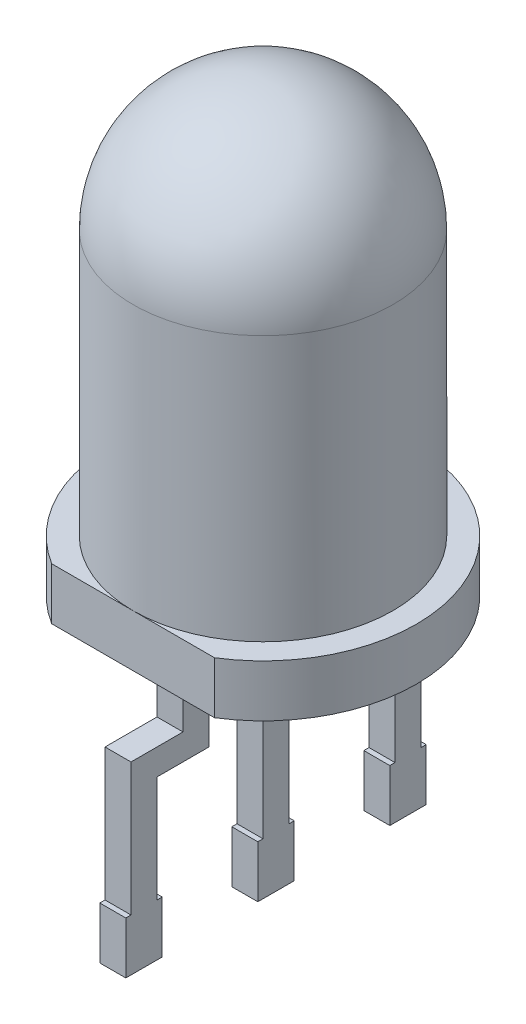
ISO-10303-21;
HEADER;
FILE_DESCRIPTION(('STEP AP214'),'2;1');
FILE_NAME('part.step','',(''),(''),'','','');
FILE_SCHEMA(('AUTOMOTIVE_DESIGN { 1 0 10303 214 1 1 1 1 }'));
ENDSEC;
DATA;
#1=APPLICATION_CONTEXT('core data for automotive mechanical design processes');
#2=APPLICATION_PROTOCOL_DEFINITION('international standard','automotive_design',2000,#1);
#3=PRODUCT_CONTEXT('',#1,'mechanical');
#4=PRODUCT('Part','Part','',(#3));
#5=PRODUCT_RELATED_PRODUCT_CATEGORY('part','',(#4));
#6=PRODUCT_DEFINITION_FORMATION('','',#4);
#7=PRODUCT_DEFINITION_CONTEXT('part definition',#1,'design');
#8=PRODUCT_DEFINITION('design','',#6,#7);
#9=PRODUCT_DEFINITION_SHAPE('','',#8);
#10=(LENGTH_UNIT() NAMED_UNIT(*) SI_UNIT(.MILLI.,.METRE.));
#11=(NAMED_UNIT(*) PLANE_ANGLE_UNIT() SI_UNIT($,.RADIAN.));
#12=(NAMED_UNIT(*) SI_UNIT($,.STERADIAN.) SOLID_ANGLE_UNIT());
#13=UNCERTAINTY_MEASURE_WITH_UNIT(LENGTH_MEASURE(1.E-05),#10,'distance_accuracy_value','');
#14=(GEOMETRIC_REPRESENTATION_CONTEXT(3) GLOBAL_UNCERTAINTY_ASSIGNED_CONTEXT((#13)) GLOBAL_UNIT_ASSIGNED_CONTEXT((#10,
#11,#12)) REPRESENTATION_CONTEXT('',''));
#15=CARTESIAN_POINT('',(0.,0.,0.));
#16=DIRECTION('',(0.,0.,1.));
#17=DIRECTION('',(1.,0.,0.));
#18=AXIS2_PLACEMENT_3D('',#15,#16,#17);
#19=CARTESIAN_POINT('',(-0.25,-4.8,2.89));
#20=DIRECTION('',(1.,0.,0.));
#21=DIRECTION('',(0.,0.,-1.));
#22=AXIS2_PLACEMENT_3D('',#19,#20,#21);
#23=PLANE('',#22);
#24=DIRECTION('',(0.,1.,0.));
#25=VECTOR('',#24,1.);
#26=CARTESIAN_POINT('',(-0.25,-2.25,2.79));
#27=LINE('',#26,#25);
#28=CARTESIAN_POINT('',(-0.25,-4.8,2.79));
#29=VERTEX_POINT('',#28);
#30=CARTESIAN_POINT('',(-0.25,-2.25,2.79));
#31=VERTEX_POINT('',#30);
#32=EDGE_CURVE('E436',#29,#31,#27,.T.);
#33=ORIENTED_EDGE('',*,*,#32,.T.);
#34=DIRECTION('',(0.,0.,-1.));
#35=VECTOR('',#34,1.);
#36=CARTESIAN_POINT('',(-0.25,-2.25,2.89));
#37=LINE('',#36,#35);
#38=CARTESIAN_POINT('',(-0.25,-2.25,1.79));
#39=VERTEX_POINT('',#38);
#40=EDGE_CURVE('E245',#39,#31,#37,.F.);
#41=ORIENTED_EDGE('',*,*,#40,.F.);
#42=DIRECTION('',(0.,1.,0.));
#43=VECTOR('',#42,1.);
#44=CARTESIAN_POINT('',(-0.25,-4.8,1.79));
#45=LINE('',#44,#43);
#46=CARTESIAN_POINT('',(-0.25,-1.,1.79));
#47=VERTEX_POINT('',#46);
#48=EDGE_CURVE('E222',#47,#39,#45,.F.);
#49=ORIENTED_EDGE('',*,*,#48,.F.);
#50=DIRECTION('',(0.,0.,-1.));
#51=VECTOR('',#50,1.);
#52=CARTESIAN_POINT('',(-0.25,-1.,2.89));
#53=LINE('',#52,#51);
#54=CARTESIAN_POINT('',(-0.25,-1.,1.29));
#55=VERTEX_POINT('',#54);
#56=EDGE_CURVE('E228',#55,#47,#53,.F.);
#57=ORIENTED_EDGE('',*,*,#56,.F.);
#58=DIRECTION('',(0.,1.,0.));
#59=VECTOR('',#58,1.);
#60=CARTESIAN_POINT('',(-0.25,-2.75,1.29));
#61=LINE('',#60,#59);
#62=CARTESIAN_POINT('',(-0.25,-2.75,1.29));
#63=VERTEX_POINT('',#62);
#64=EDGE_CURVE('E440',#55,#63,#61,.F.);
#65=ORIENTED_EDGE('',*,*,#64,.T.);
#66=DIRECTION('',(0.,0.,1.));
#67=VECTOR('',#66,1.);
#68=CARTESIAN_POINT('',(-0.25,-2.75,2.29));
#69=LINE('',#68,#67);
#70=CARTESIAN_POINT('',(-0.25,-2.75,2.29));
#71=VERTEX_POINT('',#70);
#72=EDGE_CURVE('E445',#63,#71,#69,.T.);
#73=ORIENTED_EDGE('',*,*,#72,.T.);
#74=DIRECTION('',(0.,1.,0.));
#75=VECTOR('',#74,1.);
#76=CARTESIAN_POINT('',(-0.25,-23.5,2.29));
#77=LINE('',#76,#75);
#78=CARTESIAN_POINT('',(-0.25,-4.8,2.29));
#79=VERTEX_POINT('',#78);
#80=EDGE_CURVE('E447',#71,#79,#77,.F.);
#81=ORIENTED_EDGE('',*,*,#80,.T.);
#82=DIRECTION('',(0.,0.,-1.));
#83=VECTOR('',#82,1.);
#84=CARTESIAN_POINT('',(-0.25,-4.8,2.19));
#85=LINE('',#84,#83);
#86=CARTESIAN_POINT('',(-0.25,-4.8,2.19));
#87=VERTEX_POINT('',#86);
#88=EDGE_CURVE('E454',#79,#87,#85,.T.);
#89=ORIENTED_EDGE('',*,*,#88,.T.);
#90=DIRECTION('',(0.,1.,0.));
#91=VECTOR('',#90,1.);
#92=CARTESIAN_POINT('',(-0.25,-4.8,2.19));
#93=LINE('',#92,#91);
#94=CARTESIAN_POINT('',(-0.25,-5.8,2.19));
#95=VERTEX_POINT('',#94);
#96=EDGE_CURVE('E456',#95,#87,#93,.T.);
#97=ORIENTED_EDGE('',*,*,#96,.F.);
#98=DIRECTION('',(0.,0.,1.));
#99=VECTOR('',#98,1.);
#100=CARTESIAN_POINT('',(-0.25,-5.8,0.7891280055548));
#101=LINE('',#100,#99);
#102=CARTESIAN_POINT('',(-0.25,-5.8,2.89));
#103=VERTEX_POINT('',#102);
#104=EDGE_CURVE('E462',#95,#103,#101,.T.);
#105=ORIENTED_EDGE('',*,*,#104,.T.);
#106=DIRECTION('',(0.,1.,0.));
#107=VECTOR('',#106,1.);
#108=CARTESIAN_POINT('',(-0.25,-4.8,2.89));
#109=LINE('',#108,#107);
#110=CARTESIAN_POINT('',(-0.25,-4.8,2.89));
#111=VERTEX_POINT('',#110);
#112=EDGE_CURVE('E467',#103,#111,#109,.T.);
#113=ORIENTED_EDGE('',*,*,#112,.T.);
#114=DIRECTION('',(0.,0.,-1.));
#115=VECTOR('',#114,1.);
#116=CARTESIAN_POINT('',(-0.25,-4.8,2.89));
#117=LINE('',#116,#115);
#118=EDGE_CURVE('E247',#29,#111,#117,.F.);
#119=ORIENTED_EDGE('',*,*,#118,.F.);
#120=EDGE_LOOP('',(#33,#41,#49,#57,#65,#73,#81,#89,#97,#105,#113,#119));
#121=FACE_BOUND('',#120,.T.);
#122=ADVANCED_FACE('F16',(#121),#23,.F.);
#123=CARTESIAN_POINT('',(0.25,-33.31016093332,0.7891280055548));
#124=DIRECTION('',(-1.,0.,0.));
#125=DIRECTION('',(0.,0.,1.));
#126=AXIS2_PLACEMENT_3D('',#123,#124,#125);
#127=PLANE('',#126);
#128=DIRECTION('',(0.,1.,0.));
#129=VECTOR('',#128,1.);
#130=CARTESIAN_POINT('',(0.25,-33.31016093332,-2.79));
#131=LINE('',#130,#129);
#132=CARTESIAN_POINT('',(0.25,-4.8,-2.79000000000034));
#133=VERTEX_POINT('',#132);
#134=CARTESIAN_POINT('',(0.25,-2.7499999999991,-2.79000000000152));
#135=VERTEX_POINT('',#134);
#136=EDGE_CURVE('E387',#133,#135,#131,.T.);
#137=ORIENTED_EDGE('',*,*,#136,.T.);
#138=DIRECTION('',(0.,-0.882947592858917,-0.469471562785909));
#139=VECTOR('',#138,1.);
#140=CARTESIAN_POINT('',(0.25,-25.09097723128,-14.66890830641));
#141=LINE('',#140,#139);
#142=CARTESIAN_POINT('',(0.25,-0.999999999999557,-1.85950849459334));
#143=VERTEX_POINT('',#142);
#144=EDGE_CURVE('E392',#135,#143,#141,.F.);
#145=ORIENTED_EDGE('',*,*,#144,.T.);
#146=DIRECTION('',(0.,0.,1.));
#147=VECTOR('',#146,1.);
#148=CARTESIAN_POINT('',(0.25,-0.99999999999982,0.7891280055548));
#149=LINE('',#148,#147);
#150=CARTESIAN_POINT('',(0.25,-0.999999999999865,-1.35950849459242));
#151=VERTEX_POINT('',#150);
#152=EDGE_CURVE('E477',#151,#143,#149,.F.);
#153=ORIENTED_EDGE('',*,*,#152,.F.);
#154=DIRECTION('',(0.,0.882947592858917,0.469471562785909));
#155=VECTOR('',#154,1.);
#156=CARTESIAN_POINT('',(0.25,-25.29823662442,-14.27911008054));
#157=LINE('',#156,#155);
#158=CARTESIAN_POINT('',(0.25,-2.74999999999987,-2.2900000000001));
#159=VERTEX_POINT('',#158);
#160=EDGE_CURVE('E398',#151,#159,#157,.F.);
#161=ORIENTED_EDGE('',*,*,#160,.T.);
#162=DIRECTION('',(0.,1.,0.));
#163=VECTOR('',#162,1.);
#164=CARTESIAN_POINT('',(0.25,-33.31016093332,-2.29));
#165=LINE('',#164,#163);
#166=CARTESIAN_POINT('',(0.25,-4.8,-2.29));
#167=VERTEX_POINT('',#166);
#168=EDGE_CURVE('E405',#159,#167,#165,.F.);
#169=ORIENTED_EDGE('',*,*,#168,.T.);
#170=DIRECTION('',(0.,0.,1.));
#171=VECTOR('',#170,1.);
#172=CARTESIAN_POINT('',(0.25,-4.8,0.7891280055548));
#173=LINE('',#172,#171);
#174=CARTESIAN_POINT('',(0.25,-4.8,-2.19));
#175=VERTEX_POINT('',#174);
#176=EDGE_CURVE('E410',#175,#167,#173,.F.);
#177=ORIENTED_EDGE('',*,*,#176,.F.);
#178=DIRECTION('',(0.,1.,0.));
#179=VECTOR('',#178,1.);
#180=CARTESIAN_POINT('',(0.25,-33.31016093332,-2.19));
#181=LINE('',#180,#179);
#182=CARTESIAN_POINT('',(0.25,-5.8,-2.19));
#183=VERTEX_POINT('',#182);
#184=EDGE_CURVE('E415',#183,#175,#181,.T.);
#185=ORIENTED_EDGE('',*,*,#184,.F.);
#186=DIRECTION('',(0.,0.,1.));
#187=VECTOR('',#186,1.);
#188=CARTESIAN_POINT('',(0.25,-5.8,0.7891280055548));
#189=LINE('',#188,#187);
#190=CARTESIAN_POINT('',(0.25,-5.8,-2.89));
#191=VERTEX_POINT('',#190);
#192=EDGE_CURVE('E420',#183,#191,#189,.F.);
#193=ORIENTED_EDGE('',*,*,#192,.T.);
#194=DIRECTION('',(0.,1.,0.));
#195=VECTOR('',#194,1.);
#196=CARTESIAN_POINT('',(0.25,-33.31016093332,-2.89));
#197=LINE('',#196,#195);
#198=CARTESIAN_POINT('',(0.25,-4.8,-2.89));
#199=VERTEX_POINT('',#198);
#200=EDGE_CURVE('E425',#191,#199,#197,.T.);
#201=ORIENTED_EDGE('',*,*,#200,.T.);
#202=DIRECTION('',(0.,0.,1.));
#203=VECTOR('',#202,1.);
#204=CARTESIAN_POINT('',(0.25,-4.8,0.7891280055548));
#205=LINE('',#204,#203);
#206=EDGE_CURVE('E475',#133,#199,#205,.F.);
#207=ORIENTED_EDGE('',*,*,#206,.F.);
#208=EDGE_LOOP('',(#137,#145,#153,#161,#169,#177,#185,#193,#201,#207));
#209=FACE_BOUND('',#208,.T.);
#210=ADVANCED_FACE('F543',(#209),#127,.F.);
#211=CARTESIAN_POINT('',(0.25,-1.,0.25));
#212=DIRECTION('',(1.,0.,0.));
#213=DIRECTION('',(0.,0.,-1.));
#214=AXIS2_PLACEMENT_3D('',#211,#212,#213);
#215=PLANE('',#214);
#216=DIRECTION('',(0.,1.,0.));
#217=VECTOR('',#216,1.);
#218=CARTESIAN_POINT('',(0.25,-25.5,0.25));
#219=LINE('',#218,#217);
#220=CARTESIAN_POINT('',(0.25,-4.8,0.25));
#221=VERTEX_POINT('',#220);
#222=CARTESIAN_POINT('',(0.25,-1.,0.25));
#223=VERTEX_POINT('',#222);
#224=EDGE_CURVE('E349',#221,#223,#219,.T.);
#225=ORIENTED_EDGE('',*,*,#224,.F.);
#226=DIRECTION('',(0.,0.,-1.));
#227=VECTOR('',#226,1.);
#228=CARTESIAN_POINT('',(0.25,-4.8,0.25));
#229=LINE('',#228,#227);
#230=CARTESIAN_POINT('',(0.25,-4.8,0.35));
#231=VERTEX_POINT('',#230);
#232=EDGE_CURVE('E470',#221,#231,#229,.F.);
#233=ORIENTED_EDGE('',*,*,#232,.T.);
#234=DIRECTION('',(0.,1.,0.));
#235=VECTOR('',#234,1.);
#236=CARTESIAN_POINT('',(0.25,-4.8,0.35));
#237=LINE('',#236,#235);
#238=CARTESIAN_POINT('',(0.25,-5.8,0.35));
#239=VERTEX_POINT('',#238);
#240=EDGE_CURVE('E379',#231,#239,#237,.F.);
#241=ORIENTED_EDGE('',*,*,#240,.T.);
#242=DIRECTION('',(0.,0.,1.));
#243=VECTOR('',#242,1.);
#244=CARTESIAN_POINT('',(0.25,-5.8,0.7891280055548));
#245=LINE('',#244,#243);
#246=CARTESIAN_POINT('',(0.25,-5.8,-0.35));
#247=VERTEX_POINT('',#246);
#248=EDGE_CURVE('E374',#239,#247,#245,.F.);
#249=ORIENTED_EDGE('',*,*,#248,.T.);
#250=DIRECTION('',(0.,1.,0.));
#251=VECTOR('',#250,1.);
#252=CARTESIAN_POINT('',(0.25,-4.8,-0.35));
#253=LINE('',#252,#251);
#254=CARTESIAN_POINT('',(0.25,-4.8,-0.35));
#255=VERTEX_POINT('',#254);
#256=EDGE_CURVE('E368',#255,#247,#253,.F.);
#257=ORIENTED_EDGE('',*,*,#256,.F.);
#258=DIRECTION('',(0.,0.,-1.));
#259=VECTOR('',#258,1.);
#260=CARTESIAN_POINT('',(0.25,-4.8,-0.35));
#261=LINE('',#260,#259);
#262=CARTESIAN_POINT('',(0.25,-4.8,-0.25));
#263=VERTEX_POINT('',#262);
#264=EDGE_CURVE('E366',#255,#263,#261,.F.);
#265=ORIENTED_EDGE('',*,*,#264,.T.);
#266=DIRECTION('',(0.,1.,0.));
#267=VECTOR('',#266,1.);
#268=CARTESIAN_POINT('',(0.25,-1.,-0.25));
#269=LINE('',#268,#267);
#270=CARTESIAN_POINT('',(0.25,-1.,-0.25));
#271=VERTEX_POINT('',#270);
#272=EDGE_CURVE('E357',#271,#263,#269,.F.);
#273=ORIENTED_EDGE('',*,*,#272,.F.);
#274=DIRECTION('',(0.,0.,-1.));
#275=VECTOR('',#274,1.);
#276=CARTESIAN_POINT('',(0.25,-1.,0.25));
#277=LINE('',#276,#275);
#278=EDGE_CURVE('E472',#271,#223,#277,.F.);
#279=ORIENTED_EDGE('',*,*,#278,.T.);
#280=EDGE_LOOP('',(#225,#233,#241,#249,#257,#265,#273,#279));
#281=FACE_BOUND('',#280,.T.);
#282=ADVANCED_FACE('F541',(#281),#215,.T.);
#283=CARTESIAN_POINT('',(0.25,-4.8,2.89));
#284=DIRECTION('',(0.,0.,-1.));
#285=DIRECTION('',(-1.,0.,0.));
#286=AXIS2_PLACEMENT_3D('',#283,#284,#285);
#287=PLANE('',#286);
#288=DIRECTION('',(1.,0.,0.));
#289=VECTOR('',#288,1.);
#290=CARTESIAN_POINT('',(0.25,-4.8,2.89));
#291=LINE('',#290,#289);
#292=CARTESIAN_POINT('',(0.25,-4.8,2.89));
#293=VERTEX_POINT('',#292);
#294=EDGE_CURVE('E431',#293,#111,#291,.F.);
#295=ORIENTED_EDGE('',*,*,#294,.T.);
#296=ORIENTED_EDGE('',*,*,#112,.F.);
#297=DIRECTION('',(1.,0.,0.));
#298=VECTOR('',#297,1.);
#299=CARTESIAN_POINT('',(0.25,-5.8,2.89));
#300=LINE('',#299,#298);
#301=CARTESIAN_POINT('',(0.25,-5.8,2.89));
#302=VERTEX_POINT('',#301);
#303=EDGE_CURVE('E465',#103,#302,#300,.T.);
#304=ORIENTED_EDGE('',*,*,#303,.T.);
#305=DIRECTION('',(0.,1.,0.));
#306=VECTOR('',#305,1.);
#307=CARTESIAN_POINT('',(0.25,-4.8,2.89));
#308=LINE('',#307,#306);
#309=EDGE_CURVE('E342',#293,#302,#308,.F.);
#310=ORIENTED_EDGE('',*,*,#309,.F.);
#311=EDGE_LOOP('',(#295,#296,#304,#310));
#312=FACE_BOUND('',#311,.T.);
#313=ADVANCED_FACE('F487',(#312),#287,.F.);
#314=CARTESIAN_POINT('',(0.25,-5.8,0.7891280055548));
#315=DIRECTION('',(0.,1.,0.));
#316=DIRECTION('',(0.,0.,1.));
#317=AXIS2_PLACEMENT_3D('',#314,#315,#316);
#318=PLANE('',#317);
#319=DIRECTION('',(-1.,0.,0.));
#320=VECTOR('',#319,1.);
#321=CARTESIAN_POINT('',(0.25,-5.8,2.19));
#322=LINE('',#321,#320);
#323=CARTESIAN_POINT('',(0.25,-5.8,2.19));
#324=VERTEX_POINT('',#323);
#325=EDGE_CURVE('E459',#324,#95,#322,.T.);
#326=ORIENTED_EDGE('',*,*,#325,.F.);
#327=DIRECTION('',(0.,0.,-1.));
#328=VECTOR('',#327,1.);
#329=CARTESIAN_POINT('',(0.25,-5.8,2.89));
#330=LINE('',#329,#328);
#331=EDGE_CURVE('E339',#302,#324,#330,.T.);
#332=ORIENTED_EDGE('',*,*,#331,.F.);
#333=ORIENTED_EDGE('',*,*,#303,.F.);
#334=ORIENTED_EDGE('',*,*,#104,.F.);
#335=EDGE_LOOP('',(#326,#332,#333,#334));
#336=FACE_BOUND('',#335,.T.);
#337=ADVANCED_FACE('F550',(#336),#318,.F.);
#338=CARTESIAN_POINT('',(0.25,-4.8,2.19));
#339=DIRECTION('',(0.,0.,-1.));
#340=DIRECTION('',(-1.,0.,0.));
#341=AXIS2_PLACEMENT_3D('',#338,#339,#340);
#342=PLANE('',#341);
#343=DIRECTION('',(1.,0.,0.));
#344=VECTOR('',#343,1.);
#345=CARTESIAN_POINT('',(0.25,-4.8,2.19));
#346=LINE('',#345,#344);
#347=CARTESIAN_POINT('',(0.25,-4.8,2.19));
#348=VERTEX_POINT('',#347);
#349=EDGE_CURVE('E452',#87,#348,#346,.T.);
#350=ORIENTED_EDGE('',*,*,#349,.T.);
#351=DIRECTION('',(0.,1.,0.));
#352=VECTOR('',#351,1.);
#353=CARTESIAN_POINT('',(0.25,-4.8,2.19));
#354=LINE('',#353,#352);
#355=EDGE_CURVE('E336',#324,#348,#354,.T.);
#356=ORIENTED_EDGE('',*,*,#355,.F.);
#357=ORIENTED_EDGE('',*,*,#325,.T.);
#358=ORIENTED_EDGE('',*,*,#96,.T.);
#359=EDGE_LOOP('',(#350,#356,#357,#358));
#360=FACE_BOUND('',#359,.T.);
#361=ADVANCED_FACE('F657',(#360),#342,.T.);
#362=CARTESIAN_POINT('',(0.25,-4.8,2.19));
#363=DIRECTION('',(0.,-1.,0.));
#364=DIRECTION('',(0.,0.,-1.));
#365=AXIS2_PLACEMENT_3D('',#362,#363,#364);
#366=PLANE('',#365);
#367=ORIENTED_EDGE('',*,*,#88,.F.);
#368=DIRECTION('',(1.,0.,0.));
#369=VECTOR('',#368,1.);
#370=CARTESIAN_POINT('',(0.25,-4.8,2.29));
#371=LINE('',#370,#369);
#372=CARTESIAN_POINT('',(0.25,-4.8,2.29));
#373=VERTEX_POINT('',#372);
#374=EDGE_CURVE('E450',#79,#373,#371,.T.);
#375=ORIENTED_EDGE('',*,*,#374,.T.);
#376=DIRECTION('',(0.,0.,-1.));
#377=VECTOR('',#376,1.);
#378=CARTESIAN_POINT('',(0.25,-4.8,2.89));
#379=LINE('',#378,#377);
#380=EDGE_CURVE('E333',#348,#373,#379,.F.);
#381=ORIENTED_EDGE('',*,*,#380,.F.);
#382=ORIENTED_EDGE('',*,*,#349,.F.);
#383=EDGE_LOOP('',(#367,#375,#381,#382));
#384=FACE_BOUND('',#383,.T.);
#385=ADVANCED_FACE('F653',(#384),#366,.F.);
#386=CARTESIAN_POINT('',(0.25,-23.5,2.29));
#387=DIRECTION('',(0.,0.,1.));
#388=DIRECTION('',(1.,0.,0.));
#389=AXIS2_PLACEMENT_3D('',#386,#387,#388);
#390=PLANE('',#389);
#391=DIRECTION('',(1.,0.,0.));
#392=VECTOR('',#391,1.);
#393=CARTESIAN_POINT('',(0.25,-2.75,2.29));
#394=LINE('',#393,#392);
#395=CARTESIAN_POINT('',(0.25,-2.75,2.29));
#396=VERTEX_POINT('',#395);
#397=EDGE_CURVE('E443',#71,#396,#394,.T.);
#398=ORIENTED_EDGE('',*,*,#397,.T.);
#399=DIRECTION('',(0.,1.,0.));
#400=VECTOR('',#399,1.);
#401=CARTESIAN_POINT('',(0.25,-4.8,2.29));
#402=LINE('',#401,#400);
#403=EDGE_CURVE('E330',#373,#396,#402,.T.);
#404=ORIENTED_EDGE('',*,*,#403,.F.);
#405=ORIENTED_EDGE('',*,*,#374,.F.);
#406=ORIENTED_EDGE('',*,*,#80,.F.);
#407=EDGE_LOOP('',(#398,#404,#405,#406));
#408=FACE_BOUND('',#407,.T.);
#409=ADVANCED_FACE('F649',(#408),#390,.F.);
#410=CARTESIAN_POINT('',(0.25,-2.75,2.29));
#411=DIRECTION('',(0.,1.,0.));
#412=DIRECTION('',(0.,0.,1.));
#413=AXIS2_PLACEMENT_3D('',#410,#411,#412);
#414=PLANE('',#413);
#415=ORIENTED_EDGE('',*,*,#397,.F.);
#416=ORIENTED_EDGE('',*,*,#72,.F.);
#417=DIRECTION('',(1.,0.,0.));
#418=VECTOR('',#417,1.);
#419=CARTESIAN_POINT('',(0.25,-2.75,1.29));
#420=LINE('',#419,#418);
#421=CARTESIAN_POINT('',(0.25,-2.75,1.29));
#422=VERTEX_POINT('',#421);
#423=EDGE_CURVE('E438',#63,#422,#420,.T.);
#424=ORIENTED_EDGE('',*,*,#423,.T.);
#425=DIRECTION('',(0.,0.,-1.));
#426=VECTOR('',#425,1.);
#427=CARTESIAN_POINT('',(0.25,-2.75,2.89));
#428=LINE('',#427,#426);
#429=EDGE_CURVE('E327',#396,#422,#428,.T.);
#430=ORIENTED_EDGE('',*,*,#429,.F.);
#431=EDGE_LOOP('',(#415,#416,#424,#430));
#432=FACE_BOUND('',#431,.T.);
#433=ADVANCED_FACE('F645',(#432),#414,.F.);
#434=CARTESIAN_POINT('',(0.25,-2.75,1.29));
#435=DIRECTION('',(0.,0.,1.));
#436=DIRECTION('',(1.,0.,0.));
#437=AXIS2_PLACEMENT_3D('',#434,#435,#436);
#438=PLANE('',#437);
#439=ORIENTED_EDGE('',*,*,#423,.F.);
#440=ORIENTED_EDGE('',*,*,#64,.F.);
#441=DIRECTION('',(1.,0.,0.));
#442=VECTOR('',#441,1.);
#443=CARTESIAN_POINT('',(0.25,-1.,1.29));
#444=LINE('',#443,#442);
#445=CARTESIAN_POINT('',(0.25,-1.,1.29));
#446=VERTEX_POINT('',#445);
#447=EDGE_CURVE('E232',#446,#55,#444,.F.);
#448=ORIENTED_EDGE('',*,*,#447,.F.);
#449=DIRECTION('',(0.,1.,0.));
#450=VECTOR('',#449,1.);
#451=CARTESIAN_POINT('',(0.25,-4.8,1.29));
#452=LINE('',#451,#450);
#453=EDGE_CURVE('E324',#422,#446,#452,.T.);
#454=ORIENTED_EDGE('',*,*,#453,.F.);
#455=EDGE_LOOP('',(#439,#440,#448,#454));
#456=FACE_BOUND('',#455,.T.);
#457=ADVANCED_FACE('F642',(#456),#438,.F.);
#458=CARTESIAN_POINT('',(0.25,-2.25,2.79));
#459=DIRECTION('',(0.,0.,-1.));
#460=DIRECTION('',(-1.,0.,0.));
#461=AXIS2_PLACEMENT_3D('',#458,#459,#460);
#462=PLANE('',#461);
#463=DIRECTION('',(1.,0.,0.));
#464=VECTOR('',#463,1.);
#465=CARTESIAN_POINT('',(0.25,-2.25,2.79));
#466=LINE('',#465,#464);
#467=CARTESIAN_POINT('',(0.25,-2.25,2.79));
#468=VERTEX_POINT('',#467);
#469=EDGE_CURVE('E428',#468,#31,#466,.F.);
#470=ORIENTED_EDGE('',*,*,#469,.T.);
#471=ORIENTED_EDGE('',*,*,#32,.F.);
#472=DIRECTION('',(1.,0.,0.));
#473=VECTOR('',#472,1.);
#474=CARTESIAN_POINT('',(0.25,-4.8,2.79));
#475=LINE('',#474,#473);
#476=CARTESIAN_POINT('',(0.25,-4.8,2.79));
#477=VERTEX_POINT('',#476);
#478=EDGE_CURVE('E434',#29,#477,#475,.T.);
#479=ORIENTED_EDGE('',*,*,#478,.T.);
#480=DIRECTION('',(0.,1.,0.));
#481=VECTOR('',#480,1.);
#482=CARTESIAN_POINT('',(0.25,-4.8,2.79));
#483=LINE('',#482,#481);
#484=EDGE_CURVE('E318',#468,#477,#483,.F.);
#485=ORIENTED_EDGE('',*,*,#484,.F.);
#486=EDGE_LOOP('',(#470,#471,#479,#485));
#487=FACE_BOUND('',#486,.T.);
#488=ADVANCED_FACE('F493',(#487),#462,.F.);
#489=CARTESIAN_POINT('',(0.25,-4.8,2.19));
#490=DIRECTION('',(0.,-1.,0.));
#491=DIRECTION('',(0.,0.,-1.));
#492=AXIS2_PLACEMENT_3D('',#489,#490,#491);
#493=PLANE('',#492);
#494=DIRECTION('',(0.,0.,-1.));
#495=VECTOR('',#494,1.);
#496=CARTESIAN_POINT('',(0.25,-4.8,2.89));
#497=LINE('',#496,#495);
#498=EDGE_CURVE('E315',#477,#293,#497,.F.);
#499=ORIENTED_EDGE('',*,*,#498,.F.);
#500=ORIENTED_EDGE('',*,*,#478,.F.);
#501=ORIENTED_EDGE('',*,*,#118,.T.);
#502=ORIENTED_EDGE('',*,*,#294,.F.);
#503=EDGE_LOOP('',(#499,#500,#501,#502));
#504=FACE_BOUND('',#503,.T.);
#505=ADVANCED_FACE('F482',(#504),#493,.F.);
#506=CARTESIAN_POINT('',(0.25,-2.25,1.79));
#507=DIRECTION('',(0.,-1.,0.));
#508=DIRECTION('',(0.,0.,-1.));
#509=AXIS2_PLACEMENT_3D('',#506,#507,#508);
#510=PLANE('',#509);
#511=DIRECTION('',(-1.,0.,0.));
#512=VECTOR('',#511,1.);
#513=CARTESIAN_POINT('',(0.25,-2.25,1.79));
#514=LINE('',#513,#512);
#515=CARTESIAN_POINT('',(0.25,-2.25,1.79));
#516=VERTEX_POINT('',#515);
#517=EDGE_CURVE('E313',#516,#39,#514,.T.);
#518=ORIENTED_EDGE('',*,*,#517,.T.);
#519=ORIENTED_EDGE('',*,*,#40,.T.);
#520=ORIENTED_EDGE('',*,*,#469,.F.);
#521=DIRECTION('',(0.,0.,-1.));
#522=VECTOR('',#521,1.);
#523=CARTESIAN_POINT('',(0.25,-2.25,2.89));
#524=LINE('',#523,#522);
#525=EDGE_CURVE('E321',#516,#468,#524,.F.);
#526=ORIENTED_EDGE('',*,*,#525,.F.);
#527=EDGE_LOOP('',(#518,#519,#520,#526));
#528=FACE_BOUND('',#527,.T.);
#529=ADVANCED_FACE('F495',(#528),#510,.F.);
#530=CARTESIAN_POINT('',(0.25,-33.31016093332,-2.89));
#531=DIRECTION('',(0.,0.,1.));
#532=DIRECTION('',(1.,0.,0.));
#533=AXIS2_PLACEMENT_3D('',#530,#531,#532);
#534=PLANE('',#533);
#535=DIRECTION('',(1.,0.,0.));
#536=VECTOR('',#535,1.);
#537=CARTESIAN_POINT('',(0.25,-5.8,-2.89));
#538=LINE('',#537,#536);
#539=CARTESIAN_POINT('',(-0.25,-5.8,-2.89));
#540=VERTEX_POINT('',#539);
#541=EDGE_CURVE('E423',#191,#540,#538,.F.);
#542=ORIENTED_EDGE('',*,*,#541,.T.);
#543=DIRECTION('',(0.,1.,0.));
#544=VECTOR('',#543,1.);
#545=CARTESIAN_POINT('',(-0.25,-33.31016093332,-2.89));
#546=LINE('',#545,#544);
#547=CARTESIAN_POINT('',(-0.25,-4.8,-2.89));
#548=VERTEX_POINT('',#547);
#549=EDGE_CURVE('E309',#548,#540,#546,.F.);
#550=ORIENTED_EDGE('',*,*,#549,.F.);
#551=DIRECTION('',(1.,0.,0.));
#552=VECTOR('',#551,1.);
#553=CARTESIAN_POINT('',(0.25,-4.8,-2.89));
#554=LINE('',#553,#552);
#555=EDGE_CURVE('E384',#199,#548,#554,.F.);
#556=ORIENTED_EDGE('',*,*,#555,.F.);
#557=ORIENTED_EDGE('',*,*,#200,.F.);
#558=EDGE_LOOP('',(#542,#550,#556,#557));
#559=FACE_BOUND('',#558,.T.);
#560=ADVANCED_FACE('F631',(#559),#534,.F.);
#561=CARTESIAN_POINT('',(0.25,-5.8,0.7891280055548));
#562=DIRECTION('',(0.,1.,0.));
#563=DIRECTION('',(0.,0.,1.));
#564=AXIS2_PLACEMENT_3D('',#561,#562,#563);
#565=PLANE('',#564);
#566=DIRECTION('',(1.,0.,0.));
#567=VECTOR('',#566,1.);
#568=CARTESIAN_POINT('',(0.25,-5.8,-2.19));
#569=LINE('',#568,#567);
#570=CARTESIAN_POINT('',(-0.25,-5.8,-2.19));
#571=VERTEX_POINT('',#570);
#572=EDGE_CURVE('E417',#571,#183,#569,.T.);
#573=ORIENTED_EDGE('',*,*,#572,.F.);
#574=DIRECTION('',(0.,0.,1.));
#575=VECTOR('',#574,1.);
#576=CARTESIAN_POINT('',(-0.25,-5.8,0.7891280055548));
#577=LINE('',#576,#575);
#578=EDGE_CURVE('E306',#540,#571,#577,.T.);
#579=ORIENTED_EDGE('',*,*,#578,.F.);
#580=ORIENTED_EDGE('',*,*,#541,.F.);
#581=ORIENTED_EDGE('',*,*,#192,.F.);
#582=EDGE_LOOP('',(#573,#579,#580,#581));
#583=FACE_BOUND('',#582,.T.);
#584=ADVANCED_FACE('F627',(#583),#565,.F.);
#585=CARTESIAN_POINT('',(0.25,-33.31016093332,-2.19));
#586=DIRECTION('',(0.,0.,1.));
#587=DIRECTION('',(1.,0.,0.));
#588=AXIS2_PLACEMENT_3D('',#585,#586,#587);
#589=PLANE('',#588);
#590=ORIENTED_EDGE('',*,*,#572,.T.);
#591=ORIENTED_EDGE('',*,*,#184,.T.);
#592=DIRECTION('',(1.,0.,0.));
#593=VECTOR('',#592,1.);
#594=CARTESIAN_POINT('',(0.25,-4.8,-2.19));
#595=LINE('',#594,#593);
#596=CARTESIAN_POINT('',(-0.25,-4.8,-2.19));
#597=VERTEX_POINT('',#596);
#598=EDGE_CURVE('E412',#597,#175,#595,.T.);
#599=ORIENTED_EDGE('',*,*,#598,.F.);
#600=DIRECTION('',(0.,1.,0.));
#601=VECTOR('',#600,1.);
#602=CARTESIAN_POINT('',(-0.25,-33.31016093332,-2.19));
#603=LINE('',#602,#601);
#604=EDGE_CURVE('E303',#571,#597,#603,.T.);
#605=ORIENTED_EDGE('',*,*,#604,.F.);
#606=EDGE_LOOP('',(#590,#591,#599,#605));
#607=FACE_BOUND('',#606,.T.);
#608=ADVANCED_FACE('F623',(#607),#589,.T.);
#609=CARTESIAN_POINT('',(0.25,-4.8,0.7891280055548));
#610=DIRECTION('',(0.,1.,0.));
#611=DIRECTION('',(0.,0.,1.));
#612=AXIS2_PLACEMENT_3D('',#609,#610,#611);
#613=PLANE('',#612);
#614=ORIENTED_EDGE('',*,*,#598,.T.);
#615=ORIENTED_EDGE('',*,*,#176,.T.);
#616=DIRECTION('',(-1.,0.,0.));
#617=VECTOR('',#616,1.);
#618=CARTESIAN_POINT('',(0.25,-4.8,-2.29));
#619=LINE('',#618,#617);
#620=CARTESIAN_POINT('',(-0.25,-4.8,-2.29));
#621=VERTEX_POINT('',#620);
#622=EDGE_CURVE('E408',#167,#621,#619,.T.);
#623=ORIENTED_EDGE('',*,*,#622,.T.);
#624=DIRECTION('',(0.,0.,1.));
#625=VECTOR('',#624,1.);
#626=CARTESIAN_POINT('',(-0.25,-4.8,0.7891280055548));
#627=LINE('',#626,#625);
#628=EDGE_CURVE('E300',#597,#621,#627,.F.);
#629=ORIENTED_EDGE('',*,*,#628,.F.);
#630=EDGE_LOOP('',(#614,#615,#623,#629));
#631=FACE_BOUND('',#630,.T.);
#632=ADVANCED_FACE('F619',(#631),#613,.T.);
#633=CARTESIAN_POINT('',(0.25,-33.31016093332,-2.29));
#634=DIRECTION('',(0.,0.,-1.));
#635=DIRECTION('',(-1.,0.,0.));
#636=AXIS2_PLACEMENT_3D('',#633,#634,#635);
#637=PLANE('',#636);
#638=DIRECTION('',(1.,0.,0.));
#639=VECTOR('',#638,1.);
#640=CARTESIAN_POINT('',(0.25,-2.74999999999979,-2.29000000000039));
#641=LINE('',#640,#639);
#642=CARTESIAN_POINT('',(-0.25,-2.74999999999987,-2.2900000000001));
#643=VERTEX_POINT('',#642);
#644=EDGE_CURVE('E403',#159,#643,#641,.F.);
#645=ORIENTED_EDGE('',*,*,#644,.T.);
#646=DIRECTION('',(0.,1.,0.));
#647=VECTOR('',#646,1.);
#648=CARTESIAN_POINT('',(-0.25,-33.31016093332,-2.29));
#649=LINE('',#648,#647);
#650=EDGE_CURVE('E297',#621,#643,#649,.T.);
#651=ORIENTED_EDGE('',*,*,#650,.F.);
#652=ORIENTED_EDGE('',*,*,#622,.F.);
#653=ORIENTED_EDGE('',*,*,#168,.F.);
#654=EDGE_LOOP('',(#645,#651,#652,#653));
#655=FACE_BOUND('',#654,.T.);
#656=ADVANCED_FACE('F615',(#655),#637,.F.);
#657=CARTESIAN_POINT('',(0.25,-25.29823662442,-14.27911008054));
#658=DIRECTION('',(0.,0.469471562785909,-0.882947592858917));
#659=DIRECTION('',(0.,0.882947592858917,0.469471562785909));
#660=AXIS2_PLACEMENT_3D('',#657,#658,#659);
#661=PLANE('',#660);
#662=DIRECTION('',(1.,0.,0.));
#663=VECTOR('',#662,1.);
#664=CARTESIAN_POINT('',(0.25,-0.99999999999964,-1.35950849459268));
#665=LINE('',#664,#663);
#666=CARTESIAN_POINT('',(-0.25,-0.999999999999775,-1.35950849459251));
#667=VERTEX_POINT('',#666);
#668=EDGE_CURVE('E401',#667,#151,#665,.T.);
#669=ORIENTED_EDGE('',*,*,#668,.F.);
#670=DIRECTION('',(0.,0.882947592858905,0.469471562785931));
#671=VECTOR('',#670,1.);
#672=CARTESIAN_POINT('',(-0.25,-2.74999999999995,-2.2900000000001));
#673=LINE('',#672,#671);
#674=EDGE_CURVE('E294',#643,#667,#673,.T.);
#675=ORIENTED_EDGE('',*,*,#674,.F.);
#676=ORIENTED_EDGE('',*,*,#644,.F.);
#677=ORIENTED_EDGE('',*,*,#160,.F.);
#678=EDGE_LOOP('',(#669,#675,#676,#677));
#679=FACE_BOUND('',#678,.T.);
#680=ADVANCED_FACE('F611',(#679),#661,.F.);
#681=CARTESIAN_POINT('',(0.25,-25.09097723128,-14.66890830641));
#682=DIRECTION('',(0.,-0.469471562785909,0.882947592858917));
#683=DIRECTION('',(0.,-0.882947592858917,-0.469471562785909));
#684=AXIS2_PLACEMENT_3D('',#681,#682,#683);
#685=PLANE('',#684);
#686=DIRECTION('',(1.,0.,0.));
#687=VECTOR('',#686,1.);
#688=CARTESIAN_POINT('',(0.25,-2.74999999999964,-2.79));
#689=LINE('',#688,#687);
#690=CARTESIAN_POINT('',(-0.25,-2.7499999999991,-2.79000000000152));
#691=VERTEX_POINT('',#690);
#692=EDGE_CURVE('E390',#135,#691,#689,.F.);
#693=ORIENTED_EDGE('',*,*,#692,.T.);
#694=DIRECTION('',(0.,-0.882947592858859,-0.469471562786018));
#695=VECTOR('',#694,1.);
#696=CARTESIAN_POINT('',(-0.25,-0.999999999999605,-1.85950849459275));
#697=LINE('',#696,#695);
#698=CARTESIAN_POINT('',(-0.25,-0.999999999999159,-1.8595084945939));
#699=VERTEX_POINT('',#698);
#700=EDGE_CURVE('E291',#699,#691,#697,.T.);
#701=ORIENTED_EDGE('',*,*,#700,.F.);
#702=DIRECTION('',(1.,0.,0.));
#703=VECTOR('',#702,1.);
#704=CARTESIAN_POINT('',(0.25,-0.999999999998408,-1.859508494595));
#705=LINE('',#704,#703);
#706=EDGE_CURVE('E395',#143,#699,#705,.F.);
#707=ORIENTED_EDGE('',*,*,#706,.F.);
#708=ORIENTED_EDGE('',*,*,#144,.F.);
#709=EDGE_LOOP('',(#693,#701,#707,#708));
#710=FACE_BOUND('',#709,.T.);
#711=ADVANCED_FACE('F607',(#710),#685,.F.);
#712=CARTESIAN_POINT('',(0.25,-33.31016093332,-2.79));
#713=DIRECTION('',(0.,0.,1.));
#714=DIRECTION('',(1.,0.,0.));
#715=AXIS2_PLACEMENT_3D('',#712,#713,#714);
#716=PLANE('',#715);
#717=DIRECTION('',(1.,0.,0.));
#718=VECTOR('',#717,1.);
#719=CARTESIAN_POINT('',(0.25,-4.8,-2.79));
#720=LINE('',#719,#718);
#721=CARTESIAN_POINT('',(-0.25,-4.8,-2.79000000000017));
#722=VERTEX_POINT('',#721);
#723=EDGE_CURVE('E381',#722,#133,#720,.T.);
#724=ORIENTED_EDGE('',*,*,#723,.F.);
#725=DIRECTION('',(0.,1.,0.));
#726=VECTOR('',#725,1.);
#727=CARTESIAN_POINT('',(-0.25,-33.31016093332,-2.79000000000068));
#728=LINE('',#727,#726);
#729=EDGE_CURVE('E288',#691,#722,#728,.F.);
#730=ORIENTED_EDGE('',*,*,#729,.F.);
#731=ORIENTED_EDGE('',*,*,#692,.F.);
#732=ORIENTED_EDGE('',*,*,#136,.F.);
#733=EDGE_LOOP('',(#724,#730,#731,#732));
#734=FACE_BOUND('',#733,.T.);
#735=ADVANCED_FACE('F603',(#734),#716,.F.);
#736=CARTESIAN_POINT('',(0.25,-4.8,0.7891280055548));
#737=DIRECTION('',(0.,1.,0.));
#738=DIRECTION('',(0.,0.,1.));
#739=AXIS2_PLACEMENT_3D('',#736,#737,#738);
#740=PLANE('',#739);
#741=ORIENTED_EDGE('',*,*,#723,.T.);
#742=ORIENTED_EDGE('',*,*,#206,.T.);
#743=ORIENTED_EDGE('',*,*,#555,.T.);
#744=DIRECTION('',(0.,0.,1.));
#745=VECTOR('',#744,1.);
#746=CARTESIAN_POINT('',(-0.25,-4.8,0.7891280055548));
#747=LINE('',#746,#745);
#748=EDGE_CURVE('E285',#722,#548,#747,.F.);
#749=ORIENTED_EDGE('',*,*,#748,.F.);
#750=EDGE_LOOP('',(#741,#742,#743,#749));
#751=FACE_BOUND('',#750,.T.);
#752=ADVANCED_FACE('F600',(#751),#740,.T.);
#753=CARTESIAN_POINT('',(0.25,-4.8,0.35));
#754=DIRECTION('',(0.,0.,-1.));
#755=DIRECTION('',(-1.,0.,0.));
#756=AXIS2_PLACEMENT_3D('',#753,#754,#755);
#757=PLANE('',#756);
#758=DIRECTION('',(1.,0.,0.));
#759=VECTOR('',#758,1.);
#760=CARTESIAN_POINT('',(0.25,-4.8,0.35));
#761=LINE('',#760,#759);
#762=CARTESIAN_POINT('',(-0.25,-4.8,0.35));
#763=VERTEX_POINT('',#762);
#764=EDGE_CURVE('E345',#231,#763,#761,.F.);
#765=ORIENTED_EDGE('',*,*,#764,.T.);
#766=DIRECTION('',(0.,1.,0.));
#767=VECTOR('',#766,1.);
#768=CARTESIAN_POINT('',(-0.25,-1.,0.35));
#769=LINE('',#768,#767);
#770=CARTESIAN_POINT('',(-0.25,-5.8,0.35));
#771=VERTEX_POINT('',#770);
#772=EDGE_CURVE('E283',#763,#771,#769,.F.);
#773=ORIENTED_EDGE('',*,*,#772,.T.);
#774=DIRECTION('',(1.,0.,0.));
#775=VECTOR('',#774,1.);
#776=CARTESIAN_POINT('',(0.25,-5.8,0.35));
#777=LINE('',#776,#775);
#778=EDGE_CURVE('E376',#771,#239,#777,.T.);
#779=ORIENTED_EDGE('',*,*,#778,.T.);
#780=ORIENTED_EDGE('',*,*,#240,.F.);
#781=EDGE_LOOP('',(#765,#773,#779,#780));
#782=FACE_BOUND('',#781,.T.);
#783=ADVANCED_FACE('F535',(#782),#757,.F.);
#784=CARTESIAN_POINT('',(0.25,-5.8,0.7891280055548));
#785=DIRECTION('',(0.,1.,0.));
#786=DIRECTION('',(0.,0.,1.));
#787=AXIS2_PLACEMENT_3D('',#784,#785,#786);
#788=PLANE('',#787);
#789=ORIENTED_EDGE('',*,*,#778,.F.);
#790=DIRECTION('',(0.,0.,-1.));
#791=VECTOR('',#790,1.);
#792=CARTESIAN_POINT('',(-0.25,-5.8,0.25));
#793=LINE('',#792,#791);
#794=CARTESIAN_POINT('',(-0.25,-5.8,-0.35));
#795=VERTEX_POINT('',#794);
#796=EDGE_CURVE('E281',#771,#795,#793,.T.);
#797=ORIENTED_EDGE('',*,*,#796,.T.);
#798=DIRECTION('',(-1.,0.,0.));
#799=VECTOR('',#798,1.);
#800=CARTESIAN_POINT('',(0.25,-5.8,-0.35));
#801=LINE('',#800,#799);
#802=EDGE_CURVE('E371',#247,#795,#801,.T.);
#803=ORIENTED_EDGE('',*,*,#802,.F.);
#804=ORIENTED_EDGE('',*,*,#248,.F.);
#805=EDGE_LOOP('',(#789,#797,#803,#804));
#806=FACE_BOUND('',#805,.T.);
#807=ADVANCED_FACE('F533',(#806),#788,.F.);
#808=CARTESIAN_POINT('',(0.25,-4.8,-0.35));
#809=DIRECTION('',(0.,0.,-1.));
#810=DIRECTION('',(-1.,0.,0.));
#811=AXIS2_PLACEMENT_3D('',#808,#809,#810);
#812=PLANE('',#811);
#813=DIRECTION('',(1.,0.,0.));
#814=VECTOR('',#813,1.);
#815=CARTESIAN_POINT('',(0.25,-4.8,-0.35));
#816=LINE('',#815,#814);
#817=CARTESIAN_POINT('',(-0.25,-4.8,-0.35));
#818=VERTEX_POINT('',#817);
#819=EDGE_CURVE('E363',#818,#255,#816,.T.);
#820=ORIENTED_EDGE('',*,*,#819,.T.);
#821=ORIENTED_EDGE('',*,*,#256,.T.);
#822=ORIENTED_EDGE('',*,*,#802,.T.);
#823=DIRECTION('',(0.,1.,0.));
#824=VECTOR('',#823,1.);
#825=CARTESIAN_POINT('',(-0.25,-1.,-0.35));
#826=LINE('',#825,#824);
#827=EDGE_CURVE('E279',#795,#818,#826,.T.);
#828=ORIENTED_EDGE('',*,*,#827,.T.);
#829=EDGE_LOOP('',(#820,#821,#822,#828));
#830=FACE_BOUND('',#829,.T.);
#831=ADVANCED_FACE('F528',(#830),#812,.T.);
#832=CARTESIAN_POINT('',(0.25,-4.8,-0.35));
#833=DIRECTION('',(0.,-1.,0.));
#834=DIRECTION('',(0.,0.,-1.));
#835=AXIS2_PLACEMENT_3D('',#832,#833,#834);
#836=PLANE('',#835);
#837=DIRECTION('',(0.,0.,-1.));
#838=VECTOR('',#837,1.);
#839=CARTESIAN_POINT('',(-0.25,-4.8,0.25));
#840=LINE('',#839,#838);
#841=CARTESIAN_POINT('',(-0.25,-4.8,-0.25));
#842=VERTEX_POINT('',#841);
#843=EDGE_CURVE('E277',#818,#842,#840,.F.);
#844=ORIENTED_EDGE('',*,*,#843,.T.);
#845=DIRECTION('',(-1.,0.,0.));
#846=VECTOR('',#845,1.);
#847=CARTESIAN_POINT('',(0.25,-4.8,-0.25));
#848=LINE('',#847,#846);
#849=EDGE_CURVE('E354',#263,#842,#848,.T.);
#850=ORIENTED_EDGE('',*,*,#849,.F.);
#851=ORIENTED_EDGE('',*,*,#264,.F.);
#852=ORIENTED_EDGE('',*,*,#819,.F.);
#853=EDGE_LOOP('',(#844,#850,#851,#852));
#854=FACE_BOUND('',#853,.T.);
#855=ADVANCED_FACE('F525',(#854),#836,.F.);
#856=CARTESIAN_POINT('',(0.25,-1.,-0.25));
#857=DIRECTION('',(0.,0.,-1.));
#858=DIRECTION('',(-1.,0.,0.));
#859=AXIS2_PLACEMENT_3D('',#856,#857,#858);
#860=PLANE('',#859);
#861=ORIENTED_EDGE('',*,*,#849,.T.);
#862=DIRECTION('',(0.,1.,0.));
#863=VECTOR('',#862,1.);
#864=CARTESIAN_POINT('',(-0.25,-1.,-0.25));
#865=LINE('',#864,#863);
#866=CARTESIAN_POINT('',(-0.25,-1.,-0.25));
#867=VERTEX_POINT('',#866);
#868=EDGE_CURVE('E274',#842,#867,#865,.T.);
#869=ORIENTED_EDGE('',*,*,#868,.T.);
#870=DIRECTION('',(-1.,0.,0.));
#871=VECTOR('',#870,1.);
#872=CARTESIAN_POINT('',(0.25,-1.,-0.25));
#873=LINE('',#872,#871);
#874=EDGE_CURVE('E360',#867,#271,#873,.F.);
#875=ORIENTED_EDGE('',*,*,#874,.T.);
#876=ORIENTED_EDGE('',*,*,#272,.T.);
#877=EDGE_LOOP('',(#861,#869,#875,#876));
#878=FACE_BOUND('',#877,.T.);
#879=ADVANCED_FACE('F518',(#878),#860,.T.);
#880=CARTESIAN_POINT('',(0.25,-25.5,0.25));
#881=DIRECTION('',(0.,0.,1.));
#882=DIRECTION('',(1.,0.,0.));
#883=AXIS2_PLACEMENT_3D('',#880,#881,#882);
#884=PLANE('',#883);
#885=DIRECTION('',(1.,0.,0.));
#886=VECTOR('',#885,1.);
#887=CARTESIAN_POINT('',(0.25,-4.8,0.25));
#888=LINE('',#887,#886);
#889=CARTESIAN_POINT('',(-0.25,-4.8,0.25));
#890=VERTEX_POINT('',#889);
#891=EDGE_CURVE('E347',#890,#221,#888,.T.);
#892=ORIENTED_EDGE('',*,*,#891,.T.);
#893=ORIENTED_EDGE('',*,*,#224,.T.);
#894=DIRECTION('',(1.,0.,0.));
#895=VECTOR('',#894,1.);
#896=CARTESIAN_POINT('',(0.25,-1.,0.25));
#897=LINE('',#896,#895);
#898=CARTESIAN_POINT('',(-0.25,-1.,0.25));
#899=VERTEX_POINT('',#898);
#900=EDGE_CURVE('E352',#223,#899,#897,.F.);
#901=ORIENTED_EDGE('',*,*,#900,.T.);
#902=DIRECTION('',(0.,1.,0.));
#903=VECTOR('',#902,1.);
#904=CARTESIAN_POINT('',(-0.25,-1.,0.25));
#905=LINE('',#904,#903);
#906=EDGE_CURVE('E61',#899,#890,#905,.F.);
#907=ORIENTED_EDGE('',*,*,#906,.T.);
#908=EDGE_LOOP('',(#892,#893,#901,#907));
#909=FACE_BOUND('',#908,.T.);
#910=ADVANCED_FACE('F506',(#909),#884,.T.);
#911=CARTESIAN_POINT('',(0.25,-4.8,-0.35));
#912=DIRECTION('',(0.,-1.,0.));
#913=DIRECTION('',(0.,0.,-1.));
#914=AXIS2_PLACEMENT_3D('',#911,#912,#913);
#915=PLANE('',#914);
#916=ORIENTED_EDGE('',*,*,#232,.F.);
#917=ORIENTED_EDGE('',*,*,#891,.F.);
#918=DIRECTION('',(0.,0.,-1.));
#919=VECTOR('',#918,1.);
#920=CARTESIAN_POINT('',(-0.25,-4.8,0.25));
#921=LINE('',#920,#919);
#922=EDGE_CURVE('E270',#890,#763,#921,.F.);
#923=ORIENTED_EDGE('',*,*,#922,.T.);
#924=ORIENTED_EDGE('',*,*,#764,.F.);
#925=EDGE_LOOP('',(#916,#917,#923,#924));
#926=FACE_BOUND('',#925,.T.);
#927=ADVANCED_FACE('F539',(#926),#915,.F.);
#928=CARTESIAN_POINT('',(0.25,-4.8,2.89));
#929=DIRECTION('',(1.,0.,0.));
#930=DIRECTION('',(0.,0.,-1.));
#931=AXIS2_PLACEMENT_3D('',#928,#929,#930);
#932=PLANE('',#931);
#933=ORIENTED_EDGE('',*,*,#484,.T.);
#934=ORIENTED_EDGE('',*,*,#498,.T.);
#935=ORIENTED_EDGE('',*,*,#309,.T.);
#936=ORIENTED_EDGE('',*,*,#331,.T.);
#937=ORIENTED_EDGE('',*,*,#355,.T.);
#938=ORIENTED_EDGE('',*,*,#380,.T.);
#939=ORIENTED_EDGE('',*,*,#403,.T.);
#940=ORIENTED_EDGE('',*,*,#429,.T.);
#941=ORIENTED_EDGE('',*,*,#453,.T.);
#942=DIRECTION('',(0.,0.,1.));
#943=VECTOR('',#942,1.);
#944=CARTESIAN_POINT('',(0.25,-1.,-0.225));
#945=LINE('',#944,#943);
#946=CARTESIAN_POINT('',(0.25,-1.,1.79));
#947=VERTEX_POINT('',#946);
#948=EDGE_CURVE('E241',#446,#947,#945,.T.);
#949=ORIENTED_EDGE('',*,*,#948,.T.);
#950=DIRECTION('',(0.,1.,0.));
#951=VECTOR('',#950,1.);
#952=CARTESIAN_POINT('',(0.25,-1.,1.79));
#953=LINE('',#952,#951);
#954=EDGE_CURVE('E239',#947,#516,#953,.F.);
#955=ORIENTED_EDGE('',*,*,#954,.T.);
#956=ORIENTED_EDGE('',*,*,#525,.T.);
#957=EDGE_LOOP('',(#933,#934,#935,#936,#937,#938,#939,#940,#941,#949,#955,#956));
#958=FACE_BOUND('',#957,.T.);
#959=ADVANCED_FACE('F490',(#958),#932,.T.);
#960=CARTESIAN_POINT('',(0.25,-1.,1.79));
#961=DIRECTION('',(0.,0.,-1.));
#962=DIRECTION('',(-1.,0.,0.));
#963=AXIS2_PLACEMENT_3D('',#960,#961,#962);
#964=PLANE('',#963);
#965=DIRECTION('',(1.,0.,0.));
#966=VECTOR('',#965,1.);
#967=CARTESIAN_POINT('',(-6.388825817292,-1.,1.79));
#968=LINE('',#967,#966);
#969=EDGE_CURVE('E231',#947,#47,#968,.F.);
#970=ORIENTED_EDGE('',*,*,#969,.T.);
#971=ORIENTED_EDGE('',*,*,#48,.T.);
#972=ORIENTED_EDGE('',*,*,#517,.F.);
#973=ORIENTED_EDGE('',*,*,#954,.F.);
#974=EDGE_LOOP('',(#970,#971,#972,#973));
#975=FACE_BOUND('',#974,.T.);
#976=ADVANCED_FACE('F237',(#975),#964,.F.);
#977=CARTESIAN_POINT('',(-0.25,-33.31016093332,0.7891280055548));
#978=DIRECTION('',(-1.,0.,0.));
#979=DIRECTION('',(0.,0.,1.));
#980=AXIS2_PLACEMENT_3D('',#977,#978,#979);
#981=PLANE('',#980);
#982=ORIENTED_EDGE('',*,*,#729,.T.);
#983=ORIENTED_EDGE('',*,*,#748,.T.);
#984=ORIENTED_EDGE('',*,*,#549,.T.);
#985=ORIENTED_EDGE('',*,*,#578,.T.);
#986=ORIENTED_EDGE('',*,*,#604,.T.);
#987=ORIENTED_EDGE('',*,*,#628,.T.);
#988=ORIENTED_EDGE('',*,*,#650,.T.);
#989=ORIENTED_EDGE('',*,*,#674,.T.);
#990=DIRECTION('',(0.,0.,1.));
#991=VECTOR('',#990,1.);
#992=CARTESIAN_POINT('',(-0.25,-1.,-0.225));
#993=LINE('',#992,#991);
#994=EDGE_CURVE('E240',#667,#699,#993,.F.);
#995=ORIENTED_EDGE('',*,*,#994,.T.);
#996=ORIENTED_EDGE('',*,*,#700,.T.);
#997=EDGE_LOOP('',(#982,#983,#984,#985,#986,#987,#988,#989,#995,#996));
#998=FACE_BOUND('',#997,.T.);
#999=ADVANCED_FACE('F578',(#998),#981,.T.);
#1000=CARTESIAN_POINT('',(-0.25,-1.,0.25));
#1001=DIRECTION('',(1.,0.,0.));
#1002=DIRECTION('',(0.,0.,-1.));
#1003=AXIS2_PLACEMENT_3D('',#1000,#1001,#1002);
#1004=PLANE('',#1003);
#1005=ORIENTED_EDGE('',*,*,#906,.F.);
#1006=DIRECTION('',(0.,0.,1.));
#1007=VECTOR('',#1006,1.);
#1008=CARTESIAN_POINT('',(-0.25,-1.,-0.225));
#1009=LINE('',#1008,#1007);
#1010=EDGE_CURVE('E255',#899,#867,#1009,.F.);
#1011=ORIENTED_EDGE('',*,*,#1010,.T.);
#1012=ORIENTED_EDGE('',*,*,#868,.F.);
#1013=ORIENTED_EDGE('',*,*,#843,.F.);
#1014=ORIENTED_EDGE('',*,*,#827,.F.);
#1015=ORIENTED_EDGE('',*,*,#796,.F.);
#1016=ORIENTED_EDGE('',*,*,#772,.F.);
#1017=ORIENTED_EDGE('',*,*,#922,.F.);
#1018=EDGE_LOOP('',(#1005,#1011,#1012,#1013,#1014,#1015,#1016,#1017));
#1019=FACE_BOUND('',#1018,.T.);
#1020=ADVANCED_FACE('F512',(#1019),#1004,.F.);
#1021=CARTESIAN_POINT('',(-6.388825817292,8.031967380412,2.5));
#1022=DIRECTION('',(0.,0.,1.));
#1023=DIRECTION('',(1.,0.,0.));
#1024=AXIS2_PLACEMENT_3D('',#1021,#1022,#1023);
#1025=PLANE('',#1024);
#1026=DIRECTION('',(1.,0.,0.));
#1027=VECTOR('',#1026,1.);
#1028=CARTESIAN_POINT('',(-6.388825817292,0.,2.5));
#1029=LINE('',#1028,#1027);
#1030=CARTESIAN_POINT('',(1.56604597633669,0.,2.5));
#1031=VERTEX_POINT('',#1030);
#1032=CARTESIAN_POINT('',(-1.56604597633674,0.,2.5));
#1033=VERTEX_POINT('',#1032);
#1034=EDGE_CURVE('E20',#1031,#1033,#1029,.F.);
#1035=ORIENTED_EDGE('',*,*,#1034,.T.);
#1036=DIRECTION('',(0.,1.,0.));
#1037=VECTOR('',#1036,1.);
#1038=CARTESIAN_POINT('',(-1.5660459763369,8.031967380412,2.5));
#1039=LINE('',#1038,#1037);
#1040=CARTESIAN_POINT('',(-1.56604597633674,-0.999999999999999,2.5));
#1041=VERTEX_POINT('',#1040);
#1042=EDGE_CURVE('E267',#1033,#1041,#1039,.F.);
#1043=ORIENTED_EDGE('',*,*,#1042,.T.);
#1044=DIRECTION('',(1.,0.,0.));
#1045=VECTOR('',#1044,1.);
#1046=CARTESIAN_POINT('',(-6.388825817292,-1.,2.5));
#1047=LINE('',#1046,#1045);
#1048=CARTESIAN_POINT('',(1.56604597633669,-0.999999999999999,2.5));
#1049=VERTEX_POINT('',#1048);
#1050=EDGE_CURVE('E252',#1041,#1049,#1047,.T.);
#1051=ORIENTED_EDGE('',*,*,#1050,.T.);
#1052=DIRECTION('',(0.,1.,0.));
#1053=VECTOR('',#1052,1.);
#1054=CARTESIAN_POINT('',(1.56604597633679,8.031967380412,2.5));
#1055=LINE('',#1054,#1053);
#1056=EDGE_CURVE('E35',#1049,#1031,#1055,.T.);
#1057=ORIENTED_EDGE('',*,*,#1056,.T.);
#1058=EDGE_LOOP('',(#1035,#1043,#1051,#1057));
#1059=FACE_BOUND('',#1058,.T.);
#1060=ADVANCED_FACE('F572',(#1059),#1025,.T.);
#1061=CARTESIAN_POINT('',(-6.388825817292,-1.,-0.225));
#1062=DIRECTION('',(0.,1.,0.));
#1063=DIRECTION('',(0.,0.,1.));
#1064=AXIS2_PLACEMENT_3D('',#1061,#1062,#1063);
#1065=PLANE('',#1064);
#1066=ORIENTED_EDGE('',*,*,#1050,.F.);
#1067=CARTESIAN_POINT('',(0.,-0.999999999999999,0.));
#1068=DIRECTION('',(0.,-1.,0.));
#1069=DIRECTION('',(0.,0.,-1.));
#1070=AXIS2_PLACEMENT_3D('',#1067,#1068,#1069);
#1071=CIRCLE('',#1070,2.95);
#1072=EDGE_CURVE('E251',#1049,#1041,#1071,.F.);
#1073=ORIENTED_EDGE('',*,*,#1072,.F.);
#1074=EDGE_LOOP('',(#1066,#1073));
#1075=FACE_BOUND('',#1074,.T.);
#1076=ORIENTED_EDGE('',*,*,#900,.F.);
#1077=ORIENTED_EDGE('',*,*,#278,.F.);
#1078=ORIENTED_EDGE('',*,*,#874,.F.);
#1079=ORIENTED_EDGE('',*,*,#1010,.F.);
#1080=EDGE_LOOP('',(#1076,#1077,#1078,#1079));
#1081=FACE_BOUND('',#1080,.T.);
#1082=ORIENTED_EDGE('',*,*,#668,.T.);
#1083=ORIENTED_EDGE('',*,*,#152,.T.);
#1084=ORIENTED_EDGE('',*,*,#706,.T.);
#1085=ORIENTED_EDGE('',*,*,#994,.F.);
#1086=EDGE_LOOP('',(#1082,#1083,#1084,#1085));
#1087=FACE_BOUND('',#1086,.T.);
#1088=ORIENTED_EDGE('',*,*,#948,.F.);
#1089=ORIENTED_EDGE('',*,*,#447,.T.);
#1090=ORIENTED_EDGE('',*,*,#56,.T.);
#1091=ORIENTED_EDGE('',*,*,#969,.F.);
#1092=EDGE_LOOP('',(#1088,#1089,#1090,#1091));
#1093=FACE_BOUND('',#1092,.T.);
#1094=ADVANCED_FACE('F230',(#1075,#1081,#1087,#1093),#1065,.F.);
#1095=CARTESIAN_POINT('',(0.,8.031967380412,0.));
#1096=DIRECTION('',(0.,-1.,0.));
#1097=DIRECTION('',(0.,0.,-1.));
#1098=AXIS2_PLACEMENT_3D('',#1095,#1096,#1097);
#1099=CYLINDRICAL_SURFACE('',#1098,2.95);
#1100=ORIENTED_EDGE('',*,*,#1056,.F.);
#1101=ORIENTED_EDGE('',*,*,#1072,.T.);
#1102=ORIENTED_EDGE('',*,*,#1042,.F.);
#1103=CARTESIAN_POINT('',(0.,0.,0.));
#1104=DIRECTION('',(0.,-1.,0.));
#1105=DIRECTION('',(0.,0.,-1.));
#1106=AXIS2_PLACEMENT_3D('',#1103,#1104,#1105);
#1107=CIRCLE('',#1106,2.95);
#1108=EDGE_CURVE('E47',#1031,#1033,#1107,.F.);
#1109=ORIENTED_EDGE('',*,*,#1108,.F.);
#1110=EDGE_LOOP('',(#1100,#1101,#1102,#1109));
#1111=FACE_BOUND('',#1110,.T.);
#1112=ADVANCED_FACE('F567',(#1111),#1099,.T.);
#1113=CARTESIAN_POINT('',(0.,5.1,0.));
#1114=DIRECTION('',(1.,0.,0.));
#1115=DIRECTION('',(0.,0.,1.));
#1116=AXIS2_PLACEMENT_3D('',#1113,#1114,#1115);
#1117=SPHERICAL_SURFACE('',#1116,2.5);
#1118=CARTESIAN_POINT('',(0.,5.1,0.));
#1119=DIRECTION('',(0.,-1.,0.));
#1120=DIRECTION('',(0.,0.,-1.));
#1121=AXIS2_PLACEMENT_3D('',#1118,#1119,#1120);
#1122=SPHERICAL_SURFACE('',#1121,2.5);
#1123=CARTESIAN_POINT('',(0.,5.1,0.));
#1124=DIRECTION('',(0.,-1.,0.));
#1125=DIRECTION('',(0.,0.,-1.));
#1126=AXIS2_PLACEMENT_3D('',#1123,#1124,#1125);
#1127=CIRCLE('',#1126,2.5);
#1128=CARTESIAN_POINT('',(0.,5.1,-2.5));
#1129=VERTEX_POINT('',#1128);
#1130=EDGE_CURVE('E26',#1129,#1129,#1127,.T.);
#1131=ORIENTED_EDGE('',*,*,#1130,.F.);
#1132=EDGE_LOOP('',(#1131));
#1133=FACE_BOUND('',#1132,.T.);
#1134=ADVANCED_FACE('F18',(#1133),#1122,.T.);
#1135=CARTESIAN_POINT('',(1.25,0.,0.));
#1136=DIRECTION('',(0.,1.,0.));
#1137=DIRECTION('',(0.,0.,1.));
#1138=AXIS2_PLACEMENT_3D('',#1135,#1136,#1137);
#1139=PLANE('',#1138);
#1140=CARTESIAN_POINT('',(0.,0.,0.));
#1141=DIRECTION('',(0.,-1.,0.));
#1142=DIRECTION('',(0.,0.,-1.));
#1143=AXIS2_PLACEMENT_3D('',#1140,#1141,#1142);
#1144=CIRCLE('',#1143,2.5);
#1145=CARTESIAN_POINT('',(0.,0.,-2.5));
#1146=VERTEX_POINT('',#1145);
#1147=EDGE_CURVE('E11',#1146,#1146,#1144,.F.);
#1148=ORIENTED_EDGE('',*,*,#1147,.F.);
#1149=EDGE_LOOP('',(#1148));
#1150=FACE_BOUND('',#1149,.T.);
#1151=ORIENTED_EDGE('',*,*,#1034,.F.);
#1152=ORIENTED_EDGE('',*,*,#1108,.T.);
#1153=EDGE_LOOP('',(#1151,#1152));
#1154=FACE_BOUND('',#1153,.T.);
#1155=ADVANCED_FACE('F556',(#1150,#1154),#1139,.T.);
#1156=CARTESIAN_POINT('',(0.,0.,0.));
#1157=DIRECTION('',(0.,-1.,0.));
#1158=DIRECTION('',(0.,0.,-1.));
#1159=AXIS2_PLACEMENT_3D('',#1156,#1157,#1158);
#1160=CYLINDRICAL_SURFACE('',#1159,2.5);
#1161=ORIENTED_EDGE('',*,*,#1130,.T.);
#1162=EDGE_LOOP('',(#1161));
#1163=FACE_BOUND('',#1162,.T.);
#1164=ORIENTED_EDGE('',*,*,#1147,.T.);
#1165=EDGE_LOOP('',(#1164));
#1166=FACE_BOUND('',#1165,.T.);
#1167=ADVANCED_FACE('F554',(#1163,#1166),#1160,.T.);
#1168=CLOSED_SHELL('',(#122,#210,#282,#313,#337,#361,#385,#409,#433,#457,#488,#505,#529,#560,
#584,#608,#632,#656,#680,#711,#735,#752,#783,#807,#831,#855,#879,#910,#927,#959,#976,#999,#1020,
#1060,#1094,#1112,#1134,#1155,#1167));
#1169=MANIFOLD_SOLID_BREP('B1',#1168);
#1170=ADVANCED_BREP_SHAPE_REPRESENTATION('',(#18,#1169),#14);
#1171=SHAPE_DEFINITION_REPRESENTATION(#9,#1170);
ENDSEC;
END-ISO-10303-21;
